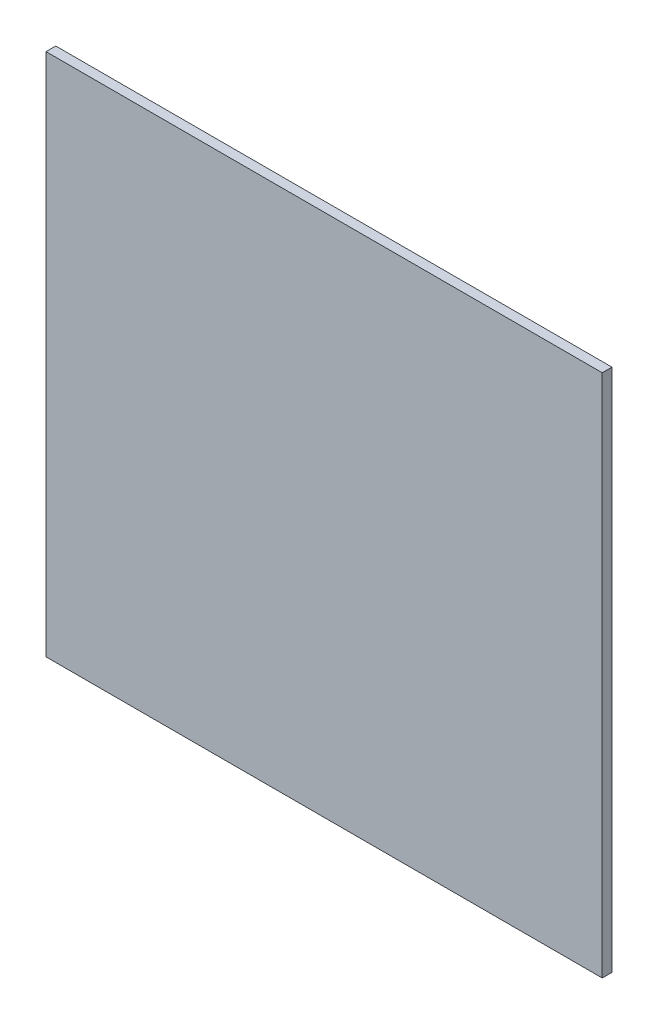
ISO-10303-21;
HEADER;
FILE_DESCRIPTION(('STEP AP214'),'2;1');
FILE_NAME('part.step','',(''),(''),'','','');
FILE_SCHEMA(('AUTOMOTIVE_DESIGN { 1 0 10303 214 1 1 1 1 }'));
ENDSEC;
DATA;
#1=APPLICATION_CONTEXT('core data for automotive mechanical design processes');
#2=APPLICATION_PROTOCOL_DEFINITION('international standard','automotive_design',2000,#1);
#3=PRODUCT_CONTEXT('',#1,'mechanical');
#4=PRODUCT('Part','Part','',(#3));
#5=PRODUCT_RELATED_PRODUCT_CATEGORY('part','',(#4));
#6=PRODUCT_DEFINITION_FORMATION('','',#4);
#7=PRODUCT_DEFINITION_CONTEXT('part definition',#1,'design');
#8=PRODUCT_DEFINITION('design','',#6,#7);
#9=PRODUCT_DEFINITION_SHAPE('','',#8);
#10=(LENGTH_UNIT() NAMED_UNIT(*) SI_UNIT(.MILLI.,.METRE.));
#11=(NAMED_UNIT(*) PLANE_ANGLE_UNIT() SI_UNIT($,.RADIAN.));
#12=(NAMED_UNIT(*) SI_UNIT($,.STERADIAN.) SOLID_ANGLE_UNIT());
#13=UNCERTAINTY_MEASURE_WITH_UNIT(LENGTH_MEASURE(1.E-05),#10,'distance_accuracy_value','');
#14=(GEOMETRIC_REPRESENTATION_CONTEXT(3) GLOBAL_UNCERTAINTY_ASSIGNED_CONTEXT((#13)) GLOBAL_UNIT_ASSIGNED_CONTEXT((#10,
#11,#12)) REPRESENTATION_CONTEXT('',''));
#15=CARTESIAN_POINT('',(0.,0.,0.));
#16=DIRECTION('',(0.,0.,1.));
#17=DIRECTION('',(1.,0.,0.));
#18=AXIS2_PLACEMENT_3D('',#15,#16,#17);
#19=CARTESIAN_POINT('',(-114.651610127908,-524.625477095242,3.));
#20=DIRECTION('',(1.,0.,0.));
#21=DIRECTION('',(0.,0.,-1.));
#22=AXIS2_PLACEMENT_3D('',#19,#20,#21);
#23=PLANE('',#22);
#24=DIRECTION('',(0.,-1.,0.));
#25=VECTOR('',#24,1.);
#26=CARTESIAN_POINT('',(-114.651610127908,-524.625477095242,0.));
#27=LINE('',#26,#25);
#28=CARTESIAN_POINT('',(-114.651610127908,-363.213986812484,0.));
#29=VERTEX_POINT('',#28);
#30=CARTESIAN_POINT('',(-114.651610127908,-524.625477095242,0.));
#31=VERTEX_POINT('',#30);
#32=EDGE_CURVE('E95',#29,#31,#27,.T.);
#33=ORIENTED_EDGE('',*,*,#32,.T.);
#34=DIRECTION('',(0.,0.,-1.));
#35=VECTOR('',#34,1.);
#36=CARTESIAN_POINT('',(-114.651610127908,-524.625477095242,3.));
#37=LINE('',#36,#35);
#38=CARTESIAN_POINT('',(-114.651610127908,-524.625477095242,3.));
#39=VERTEX_POINT('',#38);
#40=EDGE_CURVE('E11',#39,#31,#37,.T.);
#41=ORIENTED_EDGE('',*,*,#40,.F.);
#42=DIRECTION('',(0.,-1.,0.));
#43=VECTOR('',#42,1.);
#44=CARTESIAN_POINT('',(-114.651610127908,-524.625477095242,3.));
#45=LINE('',#44,#43);
#46=CARTESIAN_POINT('',(-114.651610127908,-363.213986812484,3.));
#47=VERTEX_POINT('',#46);
#48=EDGE_CURVE('E83',#47,#39,#45,.T.);
#49=ORIENTED_EDGE('',*,*,#48,.F.);
#50=DIRECTION('',(0.,0.,-1.));
#51=VECTOR('',#50,1.);
#52=CARTESIAN_POINT('',(-114.651610127908,-363.213986812484,3.));
#53=LINE('',#52,#51);
#54=EDGE_CURVE('E91',#47,#29,#53,.T.);
#55=ORIENTED_EDGE('',*,*,#54,.T.);
#56=EDGE_LOOP('',(#33,#41,#49,#55));
#57=FACE_BOUND('',#56,.T.);
#58=ADVANCED_FACE('F32',(#57),#23,.F.);
#59=CARTESIAN_POINT('',(-114.651610127908,-524.625477095242,3.));
#60=DIRECTION('',(0.,1.,0.));
#61=DIRECTION('',(0.,0.,1.));
#62=AXIS2_PLACEMENT_3D('',#59,#60,#61);
#63=PLANE('',#62);
#64=DIRECTION('',(1.,0.,0.));
#65=VECTOR('',#64,1.);
#66=CARTESIAN_POINT('',(-114.651610127908,-524.625477095242,0.));
#67=LINE('',#66,#65);
#68=CARTESIAN_POINT('',(56.6303090152047,-524.625477095242,0.));
#69=VERTEX_POINT('',#68);
#70=EDGE_CURVE('E87',#31,#69,#67,.T.);
#71=ORIENTED_EDGE('',*,*,#70,.T.);
#72=DIRECTION('',(0.,0.,-1.));
#73=VECTOR('',#72,1.);
#74=CARTESIAN_POINT('',(56.6303090152047,-524.625477095242,3.));
#75=LINE('',#74,#73);
#76=CARTESIAN_POINT('',(56.6303090152047,-524.625477095242,3.));
#77=VERTEX_POINT('',#76);
#78=EDGE_CURVE('E40',#77,#69,#75,.T.);
#79=ORIENTED_EDGE('',*,*,#78,.F.);
#80=DIRECTION('',(1.,0.,0.));
#81=VECTOR('',#80,1.);
#82=CARTESIAN_POINT('',(-114.651610127908,-524.625477095242,3.));
#83=LINE('',#82,#81);
#84=EDGE_CURVE('E78',#39,#77,#83,.T.);
#85=ORIENTED_EDGE('',*,*,#84,.F.);
#86=ORIENTED_EDGE('',*,*,#40,.T.);
#87=EDGE_LOOP('',(#71,#79,#85,#86));
#88=FACE_BOUND('',#87,.T.);
#89=ADVANCED_FACE('F86',(#88),#63,.F.);
#90=CARTESIAN_POINT('',(56.6303090152047,-524.625477095242,3.));
#91=DIRECTION('',(-1.,0.,0.));
#92=DIRECTION('',(0.,-1.,0.));
#93=AXIS2_PLACEMENT_3D('',#90,#91,#92);
#94=PLANE('',#93);
#95=DIRECTION('',(0.,1.,0.));
#96=VECTOR('',#95,1.);
#97=CARTESIAN_POINT('',(56.6303090152047,-524.625477095242,0.));
#98=LINE('',#97,#96);
#99=CARTESIAN_POINT('',(56.6303090152047,-363.213986812484,0.));
#100=VERTEX_POINT('',#99);
#101=EDGE_CURVE('E65',#69,#100,#98,.T.);
#102=ORIENTED_EDGE('',*,*,#101,.T.);
#103=DIRECTION('',(0.,0.,-1.));
#104=VECTOR('',#103,1.);
#105=CARTESIAN_POINT('',(56.6303090152047,-363.213986812484,3.));
#106=LINE('',#105,#104);
#107=CARTESIAN_POINT('',(56.6303090152047,-363.213986812484,3.));
#108=VERTEX_POINT('',#107);
#109=EDGE_CURVE('E88',#108,#100,#106,.T.);
#110=ORIENTED_EDGE('',*,*,#109,.F.);
#111=DIRECTION('',(0.,1.,0.));
#112=VECTOR('',#111,1.);
#113=CARTESIAN_POINT('',(56.6303090152047,-524.625477095242,3.));
#114=LINE('',#113,#112);
#115=EDGE_CURVE('E81',#77,#108,#114,.T.);
#116=ORIENTED_EDGE('',*,*,#115,.F.);
#117=ORIENTED_EDGE('',*,*,#78,.T.);
#118=EDGE_LOOP('',(#102,#110,#116,#117));
#119=FACE_BOUND('',#118,.T.);
#120=ADVANCED_FACE('F89',(#119),#94,.F.);
#121=CARTESIAN_POINT('',(-114.651610127908,-363.213986812484,3.));
#122=DIRECTION('',(0.,-1.,0.));
#123=DIRECTION('',(0.,0.,-1.));
#124=AXIS2_PLACEMENT_3D('',#121,#122,#123);
#125=PLANE('',#124);
#126=DIRECTION('',(-1.,0.,0.));
#127=VECTOR('',#126,1.);
#128=CARTESIAN_POINT('',(-114.651610127908,-363.213986812484,0.));
#129=LINE('',#128,#127);
#130=EDGE_CURVE('E71',#100,#29,#129,.T.);
#131=ORIENTED_EDGE('',*,*,#130,.T.);
#132=ORIENTED_EDGE('',*,*,#54,.F.);
#133=DIRECTION('',(-1.,0.,0.));
#134=VECTOR('',#133,1.);
#135=CARTESIAN_POINT('',(-114.651610127908,-363.213986812484,3.));
#136=LINE('',#135,#134);
#137=EDGE_CURVE('E48',#108,#47,#136,.T.);
#138=ORIENTED_EDGE('',*,*,#137,.F.);
#139=ORIENTED_EDGE('',*,*,#109,.T.);
#140=EDGE_LOOP('',(#131,#132,#138,#139));
#141=FACE_BOUND('',#140,.T.);
#142=ADVANCED_FACE('F102',(#141),#125,.F.);
#143=CARTESIAN_POINT('',(0.,0.,3.));
#144=DIRECTION('',(0.,0.,-1.));
#145=DIRECTION('',(-1.,0.,0.));
#146=AXIS2_PLACEMENT_3D('',#143,#144,#145);
#147=PLANE('',#146);
#148=ORIENTED_EDGE('',*,*,#48,.T.);
#149=ORIENTED_EDGE('',*,*,#84,.T.);
#150=ORIENTED_EDGE('',*,*,#115,.T.);
#151=ORIENTED_EDGE('',*,*,#137,.T.);
#152=EDGE_LOOP('',(#148,#149,#150,#151));
#153=FACE_BOUND('',#152,.T.);
#154=ADVANCED_FACE('F79',(#153),#147,.F.);
#155=CARTESIAN_POINT('',(0.,0.,0.));
#156=DIRECTION('',(0.,0.,-1.));
#157=DIRECTION('',(-1.,0.,0.));
#158=AXIS2_PLACEMENT_3D('',#155,#156,#157);
#159=PLANE('',#158);
#160=ORIENTED_EDGE('',*,*,#32,.F.);
#161=ORIENTED_EDGE('',*,*,#130,.F.);
#162=ORIENTED_EDGE('',*,*,#101,.F.);
#163=ORIENTED_EDGE('',*,*,#70,.F.);
#164=EDGE_LOOP('',(#160,#161,#162,#163));
#165=FACE_BOUND('',#164,.T.);
#166=ADVANCED_FACE('F105',(#165),#159,.T.);
#167=CLOSED_SHELL('',(#58,#89,#120,#142,#154,#166));
#168=MANIFOLD_SOLID_BREP('B2',#167);
#169=ADVANCED_BREP_SHAPE_REPRESENTATION('',(#18,#168),#14);
#170=SHAPE_DEFINITION_REPRESENTATION(#9,#169);
ENDSEC;
END-ISO-10303-21;
